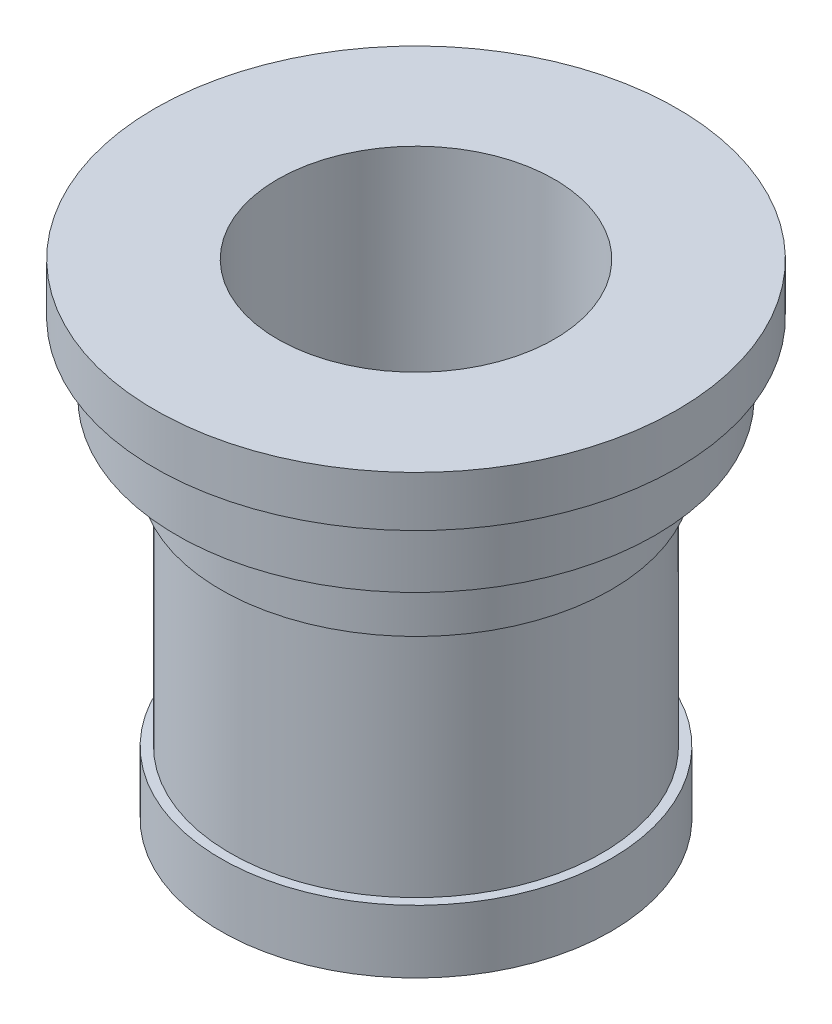
ISO-10303-21;
HEADER;
FILE_DESCRIPTION(('STEP AP214'),'2;1');
FILE_NAME('part.step','',(''),(''),'','','');
FILE_SCHEMA(('AUTOMOTIVE_DESIGN { 1 0 10303 214 1 1 1 1 }'));
ENDSEC;
DATA;
#1=APPLICATION_CONTEXT('core data for automotive mechanical design processes');
#2=APPLICATION_PROTOCOL_DEFINITION('international standard','automotive_design',2000,#1);
#3=PRODUCT_CONTEXT('',#1,'mechanical');
#4=PRODUCT('Part','Part','',(#3));
#5=PRODUCT_RELATED_PRODUCT_CATEGORY('part','',(#4));
#6=PRODUCT_DEFINITION_FORMATION('','',#4);
#7=PRODUCT_DEFINITION_CONTEXT('part definition',#1,'design');
#8=PRODUCT_DEFINITION('design','',#6,#7);
#9=PRODUCT_DEFINITION_SHAPE('','',#8);
#10=(LENGTH_UNIT() NAMED_UNIT(*) SI_UNIT(.MILLI.,.METRE.));
#11=(NAMED_UNIT(*) PLANE_ANGLE_UNIT() SI_UNIT($,.RADIAN.));
#12=(NAMED_UNIT(*) SI_UNIT($,.STERADIAN.) SOLID_ANGLE_UNIT());
#13=UNCERTAINTY_MEASURE_WITH_UNIT(LENGTH_MEASURE(1.E-05),#10,'distance_accuracy_value','');
#14=(GEOMETRIC_REPRESENTATION_CONTEXT(3) GLOBAL_UNCERTAINTY_ASSIGNED_CONTEXT((#13)) GLOBAL_UNIT_ASSIGNED_CONTEXT((#10,
#11,#12)) REPRESENTATION_CONTEXT('',''));
#15=CARTESIAN_POINT('',(0.,0.,0.));
#16=DIRECTION('',(0.,0.,1.));
#17=DIRECTION('',(1.,0.,0.));
#18=AXIS2_PLACEMENT_3D('',#15,#16,#17);
#19=CARTESIAN_POINT('',(31.,85.6268221976809,0.));
#20=DIRECTION('',(0.,1.,0.));
#21=DIRECTION('',(-1.,0.,0.));
#22=AXIS2_PLACEMENT_3D('',#19,#20,#21);
#23=CYLINDRICAL_SURFACE('',#22,31.);
#24=CARTESIAN_POINT('',(31.,0.,0.));
#25=DIRECTION('',(0.,1.,0.));
#26=DIRECTION('',(-1.,0.,0.));
#27=AXIS2_PLACEMENT_3D('',#24,#25,#26);
#28=CIRCLE('',#27,31.);
#29=CARTESIAN_POINT('',(0.,0.,0.));
#30=VERTEX_POINT('',#29);
#31=EDGE_CURVE('E70',#30,#30,#28,.T.);
#32=ORIENTED_EDGE('',*,*,#31,.T.);
#33=EDGE_LOOP('',(#32));
#34=FACE_BOUND('',#33,.T.);
#35=CARTESIAN_POINT('',(31.,9.99999999999999,0.));
#36=DIRECTION('',(0.,1.,0.));
#37=DIRECTION('',(-1.,0.,0.));
#38=AXIS2_PLACEMENT_3D('',#35,#36,#37);
#39=CIRCLE('',#38,31.);
#40=CARTESIAN_POINT('',(0.,9.99999999999999,0.));
#41=VERTEX_POINT('',#40);
#42=EDGE_CURVE('E40',#41,#41,#39,.T.);
#43=ORIENTED_EDGE('',*,*,#42,.F.);
#44=EDGE_LOOP('',(#43));
#45=FACE_BOUND('',#44,.T.);
#46=ADVANCED_FACE('F33',(#34,#45),#23,.T.);
#47=CARTESIAN_POINT('',(0.,10.,0.));
#48=DIRECTION('',(0.,1.,0.));
#49=DIRECTION('',(-1.,0.,0.));
#50=AXIS2_PLACEMENT_3D('',#47,#48,#49);
#51=PLANE('',#50);
#52=ORIENTED_EDGE('',*,*,#42,.T.);
#53=EDGE_LOOP('',(#52));
#54=FACE_BOUND('',#53,.T.);
#55=CARTESIAN_POINT('',(31.,9.99999999999999,0.));
#56=DIRECTION('',(0.,1.,0.));
#57=DIRECTION('',(-1.,0.,0.));
#58=AXIS2_PLACEMENT_3D('',#55,#56,#57);
#59=CIRCLE('',#58,29.5);
#60=CARTESIAN_POINT('',(1.5,9.99999999999999,0.));
#61=VERTEX_POINT('',#60);
#62=EDGE_CURVE('E102',#61,#61,#59,.T.);
#63=ORIENTED_EDGE('',*,*,#62,.F.);
#64=EDGE_LOOP('',(#63));
#65=FACE_BOUND('',#64,.T.);
#66=ADVANCED_FACE('F107',(#54,#65),#51,.T.);
#67=CARTESIAN_POINT('',(31.,85.6268221976809,0.));
#68=DIRECTION('',(0.,1.,0.));
#69=DIRECTION('',(-1.,0.,0.));
#70=AXIS2_PLACEMENT_3D('',#67,#68,#69);
#71=CYLINDRICAL_SURFACE('',#70,29.5);
#72=ORIENTED_EDGE('',*,*,#62,.T.);
#73=EDGE_LOOP('',(#72));
#74=FACE_BOUND('',#73,.T.);
#75=CARTESIAN_POINT('',(31.,47.,0.));
#76=DIRECTION('',(0.,1.,0.));
#77=DIRECTION('',(-1.,0.,0.));
#78=AXIS2_PLACEMENT_3D('',#75,#76,#77);
#79=CIRCLE('',#78,29.5);
#80=CARTESIAN_POINT('',(1.5,47.,0.));
#81=VERTEX_POINT('',#80);
#82=EDGE_CURVE('E99',#81,#81,#79,.T.);
#83=ORIENTED_EDGE('',*,*,#82,.F.);
#84=EDGE_LOOP('',(#83));
#85=FACE_BOUND('',#84,.T.);
#86=ADVANCED_FACE('F115',(#74,#85),#71,.T.);
#87=CARTESIAN_POINT('',(1.5,47.,0.));
#88=DIRECTION('',(0.,-1.,0.));
#89=DIRECTION('',(1.,0.,0.));
#90=AXIS2_PLACEMENT_3D('',#87,#88,#89);
#91=PLANE('',#90);
#92=ORIENTED_EDGE('',*,*,#82,.T.);
#93=EDGE_LOOP('',(#92));
#94=FACE_BOUND('',#93,.T.);
#95=CARTESIAN_POINT('',(31.,47.,0.));
#96=DIRECTION('',(0.,1.,0.));
#97=DIRECTION('',(-1.,0.,0.));
#98=AXIS2_PLACEMENT_3D('',#95,#96,#97);
#99=CIRCLE('',#98,31.);
#100=CARTESIAN_POINT('',(0.,47.,0.));
#101=VERTEX_POINT('',#100);
#102=EDGE_CURVE('E96',#101,#101,#99,.T.);
#103=ORIENTED_EDGE('',*,*,#102,.F.);
#104=EDGE_LOOP('',(#103));
#105=FACE_BOUND('',#104,.T.);
#106=ADVANCED_FACE('F153',(#94,#105),#91,.T.);
#107=CARTESIAN_POINT('',(31.,85.6268221976809,0.));
#108=DIRECTION('',(0.,1.,0.));
#109=DIRECTION('',(-1.,0.,0.));
#110=AXIS2_PLACEMENT_3D('',#107,#108,#109);
#111=CYLINDRICAL_SURFACE('',#110,31.);
#112=ORIENTED_EDGE('',*,*,#102,.T.);
#113=EDGE_LOOP('',(#112));
#114=FACE_BOUND('',#113,.T.);
#115=CARTESIAN_POINT('',(31.,58.,0.));
#116=DIRECTION('',(0.,1.,0.));
#117=DIRECTION('',(-1.,0.,0.));
#118=AXIS2_PLACEMENT_3D('',#115,#116,#117);
#119=CIRCLE('',#118,31.);
#120=CARTESIAN_POINT('',(0.,58.,0.));
#121=VERTEX_POINT('',#120);
#122=EDGE_CURVE('E93',#121,#121,#119,.T.);
#123=ORIENTED_EDGE('',*,*,#122,.F.);
#124=EDGE_LOOP('',(#123));
#125=FACE_BOUND('',#124,.T.);
#126=ADVANCED_FACE('F149',(#114,#125),#111,.T.);
#127=CARTESIAN_POINT('',(0.,58.,0.));
#128=DIRECTION('',(0.,-1.,0.));
#129=DIRECTION('',(1.,0.,0.));
#130=AXIS2_PLACEMENT_3D('',#127,#128,#129);
#131=PLANE('',#130);
#132=ORIENTED_EDGE('',*,*,#122,.T.);
#133=EDGE_LOOP('',(#132));
#134=FACE_BOUND('',#133,.T.);
#135=CARTESIAN_POINT('',(31.,58.,0.));
#136=DIRECTION('',(0.,1.,0.));
#137=DIRECTION('',(-1.,0.,0.));
#138=AXIS2_PLACEMENT_3D('',#135,#136,#137);
#139=CIRCLE('',#138,38.);
#140=CARTESIAN_POINT('',(-7.00000000000001,58.,0.));
#141=VERTEX_POINT('',#140);
#142=EDGE_CURVE('E90',#141,#141,#139,.T.);
#143=ORIENTED_EDGE('',*,*,#142,.F.);
#144=EDGE_LOOP('',(#143));
#145=FACE_BOUND('',#144,.T.);
#146=ADVANCED_FACE('F145',(#134,#145),#131,.T.);
#147=CARTESIAN_POINT('',(31.,85.6268221976809,0.));
#148=DIRECTION('',(0.,1.,0.));
#149=DIRECTION('',(-1.,0.,0.));
#150=AXIS2_PLACEMENT_3D('',#147,#148,#149);
#151=CYLINDRICAL_SURFACE('',#150,38.);
#152=ORIENTED_EDGE('',*,*,#142,.T.);
#153=EDGE_LOOP('',(#152));
#154=FACE_BOUND('',#153,.T.);
#155=CARTESIAN_POINT('',(31.,69.,0.));
#156=DIRECTION('',(0.,1.,0.));
#157=DIRECTION('',(-1.,0.,0.));
#158=AXIS2_PLACEMENT_3D('',#155,#156,#157);
#159=CIRCLE('',#158,38.);
#160=CARTESIAN_POINT('',(-7.00000000000001,69.,0.));
#161=VERTEX_POINT('',#160);
#162=EDGE_CURVE('E87',#161,#161,#159,.T.);
#163=ORIENTED_EDGE('',*,*,#162,.F.);
#164=EDGE_LOOP('',(#163));
#165=FACE_BOUND('',#164,.T.);
#166=ADVANCED_FACE('F141',(#154,#165),#151,.T.);
#167=CARTESIAN_POINT('',(-7.,69.,0.));
#168=DIRECTION('',(0.,-1.,0.));
#169=DIRECTION('',(1.,0.,0.));
#170=AXIS2_PLACEMENT_3D('',#167,#168,#169);
#171=PLANE('',#170);
#172=ORIENTED_EDGE('',*,*,#162,.T.);
#173=EDGE_LOOP('',(#172));
#174=FACE_BOUND('',#173,.T.);
#175=CARTESIAN_POINT('',(31.,69.,0.));
#176=DIRECTION('',(0.,1.,0.));
#177=DIRECTION('',(-1.,0.,0.));
#178=AXIS2_PLACEMENT_3D('',#175,#176,#177);
#179=CIRCLE('',#178,41.5);
#180=CARTESIAN_POINT('',(-10.5,69.,0.));
#181=VERTEX_POINT('',#180);
#182=EDGE_CURVE('E84',#181,#181,#179,.T.);
#183=ORIENTED_EDGE('',*,*,#182,.F.);
#184=EDGE_LOOP('',(#183));
#185=FACE_BOUND('',#184,.T.);
#186=ADVANCED_FACE('F137',(#174,#185),#171,.T.);
#187=CARTESIAN_POINT('',(31.,85.6268221976809,0.));
#188=DIRECTION('',(0.,1.,0.));
#189=DIRECTION('',(-1.,0.,0.));
#190=AXIS2_PLACEMENT_3D('',#187,#188,#189);
#191=CYLINDRICAL_SURFACE('',#190,41.5);
#192=ORIENTED_EDGE('',*,*,#182,.T.);
#193=EDGE_LOOP('',(#192));
#194=FACE_BOUND('',#193,.T.);
#195=CARTESIAN_POINT('',(31.,77.,0.));
#196=DIRECTION('',(0.,1.,0.));
#197=DIRECTION('',(-1.,0.,0.));
#198=AXIS2_PLACEMENT_3D('',#195,#196,#197);
#199=CIRCLE('',#198,41.5);
#200=CARTESIAN_POINT('',(-10.5,77.,0.));
#201=VERTEX_POINT('',#200);
#202=EDGE_CURVE('E81',#201,#201,#199,.T.);
#203=ORIENTED_EDGE('',*,*,#202,.F.);
#204=EDGE_LOOP('',(#203));
#205=FACE_BOUND('',#204,.T.);
#206=ADVANCED_FACE('F133',(#194,#205),#191,.T.);
#207=CARTESIAN_POINT('',(-10.5,77.,0.));
#208=DIRECTION('',(0.,1.,0.));
#209=DIRECTION('',(-1.,0.,0.));
#210=AXIS2_PLACEMENT_3D('',#207,#208,#209);
#211=PLANE('',#210);
#212=ORIENTED_EDGE('',*,*,#202,.T.);
#213=EDGE_LOOP('',(#212));
#214=FACE_BOUND('',#213,.T.);
#215=CARTESIAN_POINT('',(31.,77.,0.));
#216=DIRECTION('',(0.,1.,0.));
#217=DIRECTION('',(-1.,0.,0.));
#218=AXIS2_PLACEMENT_3D('',#215,#216,#217);
#219=CIRCLE('',#218,22.);
#220=CARTESIAN_POINT('',(8.99999999999999,77.,0.));
#221=VERTEX_POINT('',#220);
#222=EDGE_CURVE('E78',#221,#221,#219,.T.);
#223=ORIENTED_EDGE('',*,*,#222,.F.);
#224=EDGE_LOOP('',(#223));
#225=FACE_BOUND('',#224,.T.);
#226=ADVANCED_FACE('F127',(#214,#225),#211,.T.);
#227=CARTESIAN_POINT('',(31.,85.6268221976809,0.));
#228=DIRECTION('',(0.,1.,0.));
#229=DIRECTION('',(-1.,0.,0.));
#230=AXIS2_PLACEMENT_3D('',#227,#228,#229);
#231=CYLINDRICAL_SURFACE('',#230,22.);
#232=DIRECTION('',(0.,-1.,0.));
#233=VECTOR('',#232,1.);
#234=CARTESIAN_POINT('',(9.05113636363636,2.5,1.49912810403716));
#235=LINE('',#234,#233);
#236=CARTESIAN_POINT('',(9.05113636363636,5.,1.49912810403716));
#237=VERTEX_POINT('',#236);
#238=CARTESIAN_POINT('',(9.05113636363637,0.,1.49912810403717));
#239=VERTEX_POINT('',#238);
#240=EDGE_CURVE('E47',#237,#239,#235,.T.);
#241=ORIENTED_EDGE('',*,*,#240,.F.);
#242=CARTESIAN_POINT('',(31.,5.,0.));
#243=DIRECTION('',(0.,-1.,0.));
#244=DIRECTION('',(1.,0.,0.));
#245=AXIS2_PLACEMENT_3D('',#242,#243,#244);
#246=CIRCLE('',#245,22.);
#247=CARTESIAN_POINT('',(9.05113636363636,5.,-1.49912810403716));
#248=VERTEX_POINT('',#247);
#249=EDGE_CURVE('E11',#237,#248,#246,.T.);
#250=ORIENTED_EDGE('',*,*,#249,.T.);
#251=DIRECTION('',(0.,-1.,0.));
#252=VECTOR('',#251,1.);
#253=CARTESIAN_POINT('',(9.05113636363636,2.5,-1.49912810403716));
#254=LINE('',#253,#252);
#255=CARTESIAN_POINT('',(9.05113636363637,0.,-1.49912810403716));
#256=VERTEX_POINT('',#255);
#257=EDGE_CURVE('E63',#256,#248,#254,.F.);
#258=ORIENTED_EDGE('',*,*,#257,.F.);
#259=CARTESIAN_POINT('',(31.,0.,0.));
#260=DIRECTION('',(0.,1.,0.));
#261=DIRECTION('',(-1.,0.,0.));
#262=AXIS2_PLACEMENT_3D('',#259,#260,#261);
#263=CIRCLE('',#262,22.);
#264=EDGE_CURVE('E69',#239,#256,#263,.T.);
#265=ORIENTED_EDGE('',*,*,#264,.F.);
#266=EDGE_LOOP('',(#241,#250,#258,#265));
#267=FACE_BOUND('',#266,.T.);
#268=ORIENTED_EDGE('',*,*,#222,.T.);
#269=EDGE_LOOP('',(#268));
#270=FACE_BOUND('',#269,.T.);
#271=ADVANCED_FACE('F66',(#267,#270),#231,.F.);
#272=CARTESIAN_POINT('',(9.,0.,0.));
#273=DIRECTION('',(0.,-1.,0.));
#274=DIRECTION('',(1.,0.,0.));
#275=AXIS2_PLACEMENT_3D('',#272,#273,#274);
#276=PLANE('',#275);
#277=CARTESIAN_POINT('',(9.,0.,0.));
#278=DIRECTION('',(0.,-1.,0.));
#279=DIRECTION('',(1.,0.,0.));
#280=AXIS2_PLACEMENT_3D('',#277,#278,#279);
#281=CIRCLE('',#280,1.5);
#282=EDGE_CURVE('E51',#239,#256,#281,.T.);
#283=ORIENTED_EDGE('',*,*,#282,.F.);
#284=ORIENTED_EDGE('',*,*,#264,.T.);
#285=EDGE_LOOP('',(#283,#284));
#286=FACE_BOUND('',#285,.T.);
#287=ORIENTED_EDGE('',*,*,#31,.F.);
#288=EDGE_LOOP('',(#287));
#289=FACE_BOUND('',#288,.T.);
#290=ADVANCED_FACE('F118',(#286,#289),#276,.T.);
#291=CARTESIAN_POINT('',(9.,5.,0.));
#292=DIRECTION('',(0.,-1.,0.));
#293=DIRECTION('',(1.,0.,0.));
#294=AXIS2_PLACEMENT_3D('',#291,#292,#293);
#295=CYLINDRICAL_SURFACE('',#294,1.5);
#296=ORIENTED_EDGE('',*,*,#240,.T.);
#297=ORIENTED_EDGE('',*,*,#282,.T.);
#298=ORIENTED_EDGE('',*,*,#257,.T.);
#299=CARTESIAN_POINT('',(9.,5.,0.));
#300=DIRECTION('',(0.,-1.,0.));
#301=DIRECTION('',(1.,0.,0.));
#302=AXIS2_PLACEMENT_3D('',#299,#300,#301);
#303=CIRCLE('',#302,1.5);
#304=EDGE_CURVE('E60',#237,#248,#303,.T.);
#305=ORIENTED_EDGE('',*,*,#304,.F.);
#306=EDGE_LOOP('',(#296,#297,#298,#305));
#307=FACE_BOUND('',#306,.T.);
#308=ADVANCED_FACE('F62',(#307),#295,.F.);
#309=CARTESIAN_POINT('',(9.,5.,0.));
#310=DIRECTION('',(0.,-1.,0.));
#311=DIRECTION('',(1.,0.,0.));
#312=AXIS2_PLACEMENT_3D('',#309,#310,#311);
#313=PLANE('',#312);
#314=ORIENTED_EDGE('',*,*,#304,.T.);
#315=ORIENTED_EDGE('',*,*,#249,.F.);
#316=EDGE_LOOP('',(#314,#315));
#317=FACE_BOUND('',#316,.T.);
#318=ADVANCED_FACE('F59',(#317),#313,.T.);
#319=CLOSED_SHELL('',(#46,#66,#86,#106,#126,#146,#166,#186,#206,#226,#271,#290,#308,#318));
#320=MANIFOLD_SOLID_BREP('B2',#319);
#321=ADVANCED_BREP_SHAPE_REPRESENTATION('',(#18,#320),#14);
#322=SHAPE_DEFINITION_REPRESENTATION(#9,#321);
ENDSEC;
END-ISO-10303-21;
